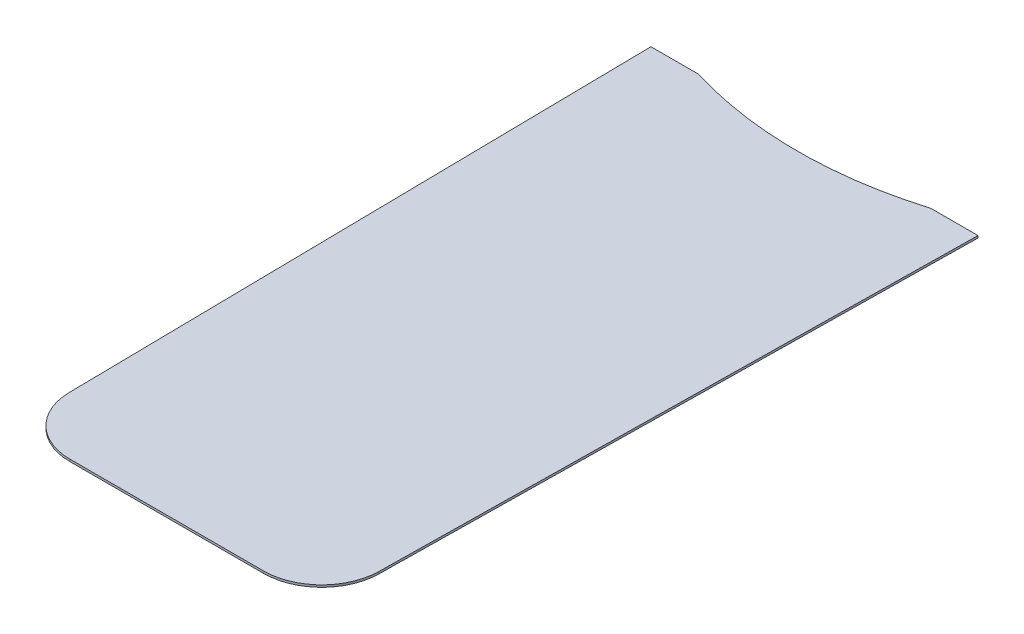
ISO-10303-21;
HEADER;
FILE_DESCRIPTION(('STEP AP214'),'2;1');
FILE_NAME('part.step','',(''),(''),'','','');
FILE_SCHEMA(('AUTOMOTIVE_DESIGN { 1 0 10303 214 1 1 1 1 }'));
ENDSEC;
DATA;
#1=APPLICATION_CONTEXT('core data for automotive mechanical design processes');
#2=APPLICATION_PROTOCOL_DEFINITION('international standard','automotive_design',2000,#1);
#3=PRODUCT_CONTEXT('',#1,'mechanical');
#4=PRODUCT('Part','Part','',(#3));
#5=PRODUCT_RELATED_PRODUCT_CATEGORY('part','',(#4));
#6=PRODUCT_DEFINITION_FORMATION('','',#4);
#7=PRODUCT_DEFINITION_CONTEXT('part definition',#1,'design');
#8=PRODUCT_DEFINITION('design','',#6,#7);
#9=PRODUCT_DEFINITION_SHAPE('','',#8);
#10=(LENGTH_UNIT() NAMED_UNIT(*) SI_UNIT(.MILLI.,.METRE.));
#11=(NAMED_UNIT(*) PLANE_ANGLE_UNIT() SI_UNIT($,.RADIAN.));
#12=(NAMED_UNIT(*) SI_UNIT($,.STERADIAN.) SOLID_ANGLE_UNIT());
#13=UNCERTAINTY_MEASURE_WITH_UNIT(LENGTH_MEASURE(1.E-05),#10,'distance_accuracy_value','');
#14=(GEOMETRIC_REPRESENTATION_CONTEXT(3) GLOBAL_UNCERTAINTY_ASSIGNED_CONTEXT((#13)) GLOBAL_UNIT_ASSIGNED_CONTEXT((#10,
#11,#12)) REPRESENTATION_CONTEXT('',''));
#15=CARTESIAN_POINT('',(0.,0.,0.));
#16=DIRECTION('',(0.,0.,1.));
#17=DIRECTION('',(1.,0.,0.));
#18=AXIS2_PLACEMENT_3D('',#15,#16,#17);
#19=CARTESIAN_POINT('',(-22.5,-0.25,59.75));
#20=DIRECTION('',(0.,1.,0.));
#21=DIRECTION('',(0.,0.,1.));
#22=AXIS2_PLACEMENT_3D('',#19,#20,#21);
#23=CYLINDRICAL_SURFACE('',#22,13.5);
#24=CARTESIAN_POINT('',(-22.5,0.25,59.75));
#25=DIRECTION('',(0.,1.,0.));
#26=DIRECTION('',(0.,0.,1.));
#27=AXIS2_PLACEMENT_3D('',#24,#25,#26);
#28=CIRCLE('',#27,13.5);
#29=CARTESIAN_POINT('',(-35.9985637525366,0.25,59.9469177968198));
#30=VERTEX_POINT('',#29);
#31=CARTESIAN_POINT('',(-22.5,0.25,73.25));
#32=VERTEX_POINT('',#31);
#33=EDGE_CURVE('E132',#30,#32,#28,.T.);
#34=ORIENTED_EDGE('',*,*,#33,.F.);
#35=DIRECTION('',(0.,1.,0.));
#36=VECTOR('',#35,1.);
#37=CARTESIAN_POINT('',(-35.9985637525366,-137.46151555172,59.9469177968198));
#38=LINE('',#37,#36);
#39=CARTESIAN_POINT('',(-35.9985637525366,-0.25,59.9469177968198));
#40=VERTEX_POINT('',#39);
#41=EDGE_CURVE('E154',#40,#30,#38,.T.);
#42=ORIENTED_EDGE('',*,*,#41,.F.);
#43=CARTESIAN_POINT('',(-22.5,-0.25,59.75));
#44=DIRECTION('',(0.,1.,0.));
#45=DIRECTION('',(0.,0.,1.));
#46=AXIS2_PLACEMENT_3D('',#43,#44,#45);
#47=CIRCLE('',#46,13.5);
#48=CARTESIAN_POINT('',(-22.5,-0.25,73.25));
#49=VERTEX_POINT('',#48);
#50=EDGE_CURVE('E77',#40,#49,#47,.T.);
#51=ORIENTED_EDGE('',*,*,#50,.T.);
#52=DIRECTION('',(0.,1.,0.));
#53=VECTOR('',#52,1.);
#54=CARTESIAN_POINT('',(-22.5,-0.25,73.25));
#55=LINE('',#54,#53);
#56=EDGE_CURVE('E36',#49,#32,#55,.T.);
#57=ORIENTED_EDGE('',*,*,#56,.T.);
#58=EDGE_LOOP('',(#34,#42,#51,#57));
#59=FACE_BOUND('',#58,.T.);
#60=ADVANCED_FACE('F33',(#59),#23,.T.);
#61=CARTESIAN_POINT('',(-36.,-0.25,-77.25));
#62=DIRECTION('',(0.,0.,-1.));
#63=DIRECTION('',(-1.,0.,0.));
#64=AXIS2_PLACEMENT_3D('',#61,#62,#63);
#65=PLANE('',#64);
#66=DIRECTION('',(-1.,0.,0.));
#67=VECTOR('',#66,1.);
#68=CARTESIAN_POINT('',(-36.,0.25,-77.25));
#69=LINE('',#68,#67);
#70=CARTESIAN_POINT('',(-27.,0.25,-77.25));
#71=VERTEX_POINT('',#70);
#72=CARTESIAN_POINT('',(-38.,0.25,-77.25));
#73=VERTEX_POINT('',#72);
#74=EDGE_CURVE('E137',#71,#73,#69,.T.);
#75=ORIENTED_EDGE('',*,*,#74,.F.);
#76=DIRECTION('',(0.,1.,0.));
#77=VECTOR('',#76,1.);
#78=CARTESIAN_POINT('',(-27.,-0.25,-77.25));
#79=LINE('',#78,#77);
#80=CARTESIAN_POINT('',(-27.,-0.25,-77.25));
#81=VERTEX_POINT('',#80);
#82=EDGE_CURVE('E11',#81,#71,#79,.T.);
#83=ORIENTED_EDGE('',*,*,#82,.F.);
#84=DIRECTION('',(-1.,0.,0.));
#85=VECTOR('',#84,1.);
#86=CARTESIAN_POINT('',(-36.,-0.25,-77.25));
#87=LINE('',#86,#85);
#88=CARTESIAN_POINT('',(-38.,-0.25,-77.25));
#89=VERTEX_POINT('',#88);
#90=EDGE_CURVE('E142',#81,#89,#87,.T.);
#91=ORIENTED_EDGE('',*,*,#90,.T.);
#92=DIRECTION('',(0.,1.,0.));
#93=VECTOR('',#92,1.);
#94=CARTESIAN_POINT('',(-38.,-137.46151555172,-77.25));
#95=LINE('',#94,#93);
#96=EDGE_CURVE('E158',#89,#73,#95,.T.);
#97=ORIENTED_EDGE('',*,*,#96,.T.);
#98=EDGE_LOOP('',(#75,#83,#91,#97));
#99=FACE_BOUND('',#98,.T.);
#100=ADVANCED_FACE('F173',(#99),#65,.T.);
#101=CARTESIAN_POINT('',(0.,-0.25,-166.375));
#102=DIRECTION('',(0.,1.,0.));
#103=DIRECTION('',(0.,0.,1.));
#104=AXIS2_PLACEMENT_3D('',#101,#102,#103);
#105=CYLINDRICAL_SURFACE('',#104,93.1249999999999);
#106=CARTESIAN_POINT('',(0.,0.25,-166.375));
#107=DIRECTION('',(0.,-1.,0.));
#108=DIRECTION('',(0.,0.,1.));
#109=AXIS2_PLACEMENT_3D('',#106,#107,#108);
#110=CIRCLE('',#109,93.1249999999999);
#111=CARTESIAN_POINT('',(27.,0.25,-77.25));
#112=VERTEX_POINT('',#111);
#113=EDGE_CURVE('E130',#112,#71,#110,.T.);
#114=ORIENTED_EDGE('',*,*,#113,.F.);
#115=DIRECTION('',(0.,1.,0.));
#116=VECTOR('',#115,1.);
#117=CARTESIAN_POINT('',(27.,-0.25,-77.25));
#118=LINE('',#117,#116);
#119=CARTESIAN_POINT('',(27.,-0.25,-77.25));
#120=VERTEX_POINT('',#119);
#121=EDGE_CURVE('E42',#120,#112,#118,.T.);
#122=ORIENTED_EDGE('',*,*,#121,.F.);
#123=CARTESIAN_POINT('',(0.,-0.25,-166.375));
#124=DIRECTION('',(0.,-1.,0.));
#125=DIRECTION('',(0.,0.,1.));
#126=AXIS2_PLACEMENT_3D('',#123,#124,#125);
#127=CIRCLE('',#126,93.1249999999999);
#128=EDGE_CURVE('E144',#120,#81,#127,.T.);
#129=ORIENTED_EDGE('',*,*,#128,.T.);
#130=ORIENTED_EDGE('',*,*,#82,.T.);
#131=EDGE_LOOP('',(#114,#122,#129,#130));
#132=FACE_BOUND('',#131,.T.);
#133=ADVANCED_FACE('F172',(#132),#105,.F.);
#134=CARTESIAN_POINT('',(36.,-0.25,-77.25));
#135=DIRECTION('',(0.,0.,-1.));
#136=DIRECTION('',(-1.,0.,0.));
#137=AXIS2_PLACEMENT_3D('',#134,#135,#136);
#138=PLANE('',#137);
#139=DIRECTION('',(-1.,0.,0.));
#140=VECTOR('',#139,1.);
#141=CARTESIAN_POINT('',(36.,0.25,-77.25));
#142=LINE('',#141,#140);
#143=CARTESIAN_POINT('',(38.,0.25,-77.25));
#144=VERTEX_POINT('',#143);
#145=EDGE_CURVE('E128',#144,#112,#142,.T.);
#146=ORIENTED_EDGE('',*,*,#145,.F.);
#147=DIRECTION('',(0.,1.,0.));
#148=VECTOR('',#147,1.);
#149=CARTESIAN_POINT('',(38.,-137.46151555172,-77.25));
#150=LINE('',#149,#148);
#151=CARTESIAN_POINT('',(38.,-0.25,-77.25));
#152=VERTEX_POINT('',#151);
#153=EDGE_CURVE('E112',#152,#144,#150,.T.);
#154=ORIENTED_EDGE('',*,*,#153,.F.);
#155=DIRECTION('',(-1.,0.,0.));
#156=VECTOR('',#155,1.);
#157=CARTESIAN_POINT('',(36.,-0.25,-77.25));
#158=LINE('',#157,#156);
#159=EDGE_CURVE('E149',#152,#120,#158,.T.);
#160=ORIENTED_EDGE('',*,*,#159,.T.);
#161=ORIENTED_EDGE('',*,*,#121,.T.);
#162=EDGE_LOOP('',(#146,#154,#160,#161));
#163=FACE_BOUND('',#162,.T.);
#164=ADVANCED_FACE('F169',(#163),#138,.T.);
#165=CARTESIAN_POINT('',(22.5,-0.25,59.75));
#166=DIRECTION('',(0.,1.,0.));
#167=DIRECTION('',(0.,0.,1.));
#168=AXIS2_PLACEMENT_3D('',#165,#166,#167);
#169=CYLINDRICAL_SURFACE('',#168,13.5);
#170=DIRECTION('',(0.,1.,0.));
#171=VECTOR('',#170,1.);
#172=CARTESIAN_POINT('',(35.9985637525367,-137.46151555172,59.9469177968198));
#173=LINE('',#172,#171);
#174=CARTESIAN_POINT('',(35.9985637525367,-0.25,59.9469177968198));
#175=VERTEX_POINT('',#174);
#176=CARTESIAN_POINT('',(35.9985637525367,0.25,59.9469177968198));
#177=VERTEX_POINT('',#176);
#178=EDGE_CURVE('E109',#175,#177,#173,.T.);
#179=ORIENTED_EDGE('',*,*,#178,.T.);
#180=CARTESIAN_POINT('',(22.5,0.25,59.75));
#181=DIRECTION('',(0.,1.,0.));
#182=DIRECTION('',(0.,0.,1.));
#183=AXIS2_PLACEMENT_3D('',#180,#181,#182);
#184=CIRCLE('',#183,13.5);
#185=CARTESIAN_POINT('',(22.5,0.25,73.25));
#186=VERTEX_POINT('',#185);
#187=EDGE_CURVE('E120',#186,#177,#184,.T.);
#188=ORIENTED_EDGE('',*,*,#187,.F.);
#189=DIRECTION('',(0.,1.,0.));
#190=VECTOR('',#189,1.);
#191=CARTESIAN_POINT('',(22.5,-0.25,73.25));
#192=LINE('',#191,#190);
#193=CARTESIAN_POINT('',(22.5,-0.25,73.25));
#194=VERTEX_POINT('',#193);
#195=EDGE_CURVE('E139',#194,#186,#192,.T.);
#196=ORIENTED_EDGE('',*,*,#195,.F.);
#197=CARTESIAN_POINT('',(22.5,-0.25,59.75));
#198=DIRECTION('',(0.,1.,0.));
#199=DIRECTION('',(0.,0.,1.));
#200=AXIS2_PLACEMENT_3D('',#197,#198,#199);
#201=CIRCLE('',#200,13.5);
#202=EDGE_CURVE('E123',#194,#175,#201,.T.);
#203=ORIENTED_EDGE('',*,*,#202,.T.);
#204=EDGE_LOOP('',(#179,#188,#196,#203));
#205=FACE_BOUND('',#204,.T.);
#206=ADVANCED_FACE('F119',(#205),#169,.T.);
#207=CARTESIAN_POINT('',(-22.5,-0.25,73.25));
#208=DIRECTION('',(0.,0.,1.));
#209=DIRECTION('',(1.,0.,0.));
#210=AXIS2_PLACEMENT_3D('',#207,#208,#209);
#211=PLANE('',#210);
#212=DIRECTION('',(1.,0.,0.));
#213=VECTOR('',#212,1.);
#214=CARTESIAN_POINT('',(-22.5,0.25,73.25));
#215=LINE('',#214,#213);
#216=EDGE_CURVE('E127',#32,#186,#215,.T.);
#217=ORIENTED_EDGE('',*,*,#216,.F.);
#218=ORIENTED_EDGE('',*,*,#56,.F.);
#219=DIRECTION('',(1.,0.,0.));
#220=VECTOR('',#219,1.);
#221=CARTESIAN_POINT('',(-22.5,-0.25,73.25));
#222=LINE('',#221,#220);
#223=EDGE_CURVE('E167',#49,#194,#222,.T.);
#224=ORIENTED_EDGE('',*,*,#223,.T.);
#225=ORIENTED_EDGE('',*,*,#195,.T.);
#226=EDGE_LOOP('',(#217,#218,#224,#225));
#227=FACE_BOUND('',#226,.T.);
#228=ADVANCED_FACE('F178',(#227),#211,.T.);
#229=CARTESIAN_POINT('',(-22.5,-0.25,59.75));
#230=DIRECTION('',(0.,1.,0.));
#231=DIRECTION('',(0.,0.,1.));
#232=AXIS2_PLACEMENT_3D('',#229,#230,#231);
#233=PLANE('',#232);
#234=ORIENTED_EDGE('',*,*,#50,.F.);
#235=DIRECTION('',(-0.0145865034681359,0.,-0.999893611299009));
#236=VECTOR('',#235,1.);
#237=CARTESIAN_POINT('',(-35.9985637525366,-0.25,59.9469177968198));
#238=LINE('',#237,#236);
#239=EDGE_CURVE('E152',#40,#89,#238,.T.);
#240=ORIENTED_EDGE('',*,*,#239,.T.);
#241=ORIENTED_EDGE('',*,*,#90,.F.);
#242=ORIENTED_EDGE('',*,*,#128,.F.);
#243=ORIENTED_EDGE('',*,*,#159,.F.);
#244=DIRECTION('',(-0.0145865034681357,0.,0.999893611299009));
#245=VECTOR('',#244,1.);
#246=CARTESIAN_POINT('',(35.9985637525367,-0.25,59.9469177968198));
#247=LINE('',#246,#245);
#248=EDGE_CURVE('E162',#152,#175,#247,.T.);
#249=ORIENTED_EDGE('',*,*,#248,.T.);
#250=ORIENTED_EDGE('',*,*,#202,.F.);
#251=ORIENTED_EDGE('',*,*,#223,.F.);
#252=EDGE_LOOP('',(#234,#240,#241,#242,#243,#249,#250,#251));
#253=FACE_BOUND('',#252,.T.);
#254=ADVANCED_FACE('F171',(#253),#233,.F.);
#255=CARTESIAN_POINT('',(-22.5,0.25,59.75));
#256=DIRECTION('',(0.,1.,0.));
#257=DIRECTION('',(0.,0.,1.));
#258=AXIS2_PLACEMENT_3D('',#255,#256,#257);
#259=PLANE('',#258);
#260=ORIENTED_EDGE('',*,*,#187,.T.);
#261=DIRECTION('',(0.0145865034681357,0.,-0.999893611299009));
#262=VECTOR('',#261,1.);
#263=CARTESIAN_POINT('',(35.9985637525367,0.25,59.9469177968198));
#264=LINE('',#263,#262);
#265=EDGE_CURVE('E105',#177,#144,#264,.T.);
#266=ORIENTED_EDGE('',*,*,#265,.T.);
#267=ORIENTED_EDGE('',*,*,#145,.T.);
#268=ORIENTED_EDGE('',*,*,#113,.T.);
#269=ORIENTED_EDGE('',*,*,#74,.T.);
#270=DIRECTION('',(0.0145865034681359,0.,0.999893611299009));
#271=VECTOR('',#270,1.);
#272=CARTESIAN_POINT('',(-35.9985637525366,0.25,59.9469177968198));
#273=LINE('',#272,#271);
#274=EDGE_CURVE('E163',#73,#30,#273,.T.);
#275=ORIENTED_EDGE('',*,*,#274,.T.);
#276=ORIENTED_EDGE('',*,*,#33,.T.);
#277=ORIENTED_EDGE('',*,*,#216,.T.);
#278=EDGE_LOOP('',(#260,#266,#267,#268,#269,#275,#276,#277));
#279=FACE_BOUND('',#278,.T.);
#280=ADVANCED_FACE('F125',(#279),#259,.T.);
#281=CARTESIAN_POINT('',(-35.9985637525366,-137.46151555172,59.9469177968198));
#282=DIRECTION('',(-0.999893611299009,0.,0.0145865034681359));
#283=DIRECTION('',(0.0145865034681359,0.,0.999893611299009));
#284=AXIS2_PLACEMENT_3D('',#281,#282,#283);
#285=PLANE('',#284);
#286=ORIENTED_EDGE('',*,*,#239,.F.);
#287=ORIENTED_EDGE('',*,*,#41,.T.);
#288=ORIENTED_EDGE('',*,*,#274,.F.);
#289=ORIENTED_EDGE('',*,*,#96,.F.);
#290=EDGE_LOOP('',(#286,#287,#288,#289));
#291=FACE_BOUND('',#290,.T.);
#292=ADVANCED_FACE('F176',(#291),#285,.T.);
#293=CARTESIAN_POINT('',(35.9985637525367,-137.46151555172,59.9469177968198));
#294=DIRECTION('',(0.999893611299009,0.,0.0145865034681357));
#295=DIRECTION('',(0.0145865034681357,0.,-0.999893611299009));
#296=AXIS2_PLACEMENT_3D('',#293,#294,#295);
#297=PLANE('',#296);
#298=ORIENTED_EDGE('',*,*,#248,.F.);
#299=ORIENTED_EDGE('',*,*,#153,.T.);
#300=ORIENTED_EDGE('',*,*,#265,.F.);
#301=ORIENTED_EDGE('',*,*,#178,.F.);
#302=EDGE_LOOP('',(#298,#299,#300,#301));
#303=FACE_BOUND('',#302,.T.);
#304=ADVANCED_FACE('F108',(#303),#297,.T.);
#305=CLOSED_SHELL('',(#60,#100,#133,#164,#206,#228,#254,#280,#292,#304));
#306=MANIFOLD_SOLID_BREP('B2',#305);
#307=ADVANCED_BREP_SHAPE_REPRESENTATION('',(#18,#306),#14);
#308=SHAPE_DEFINITION_REPRESENTATION(#9,#307);
ENDSEC;
END-ISO-10303-21;
